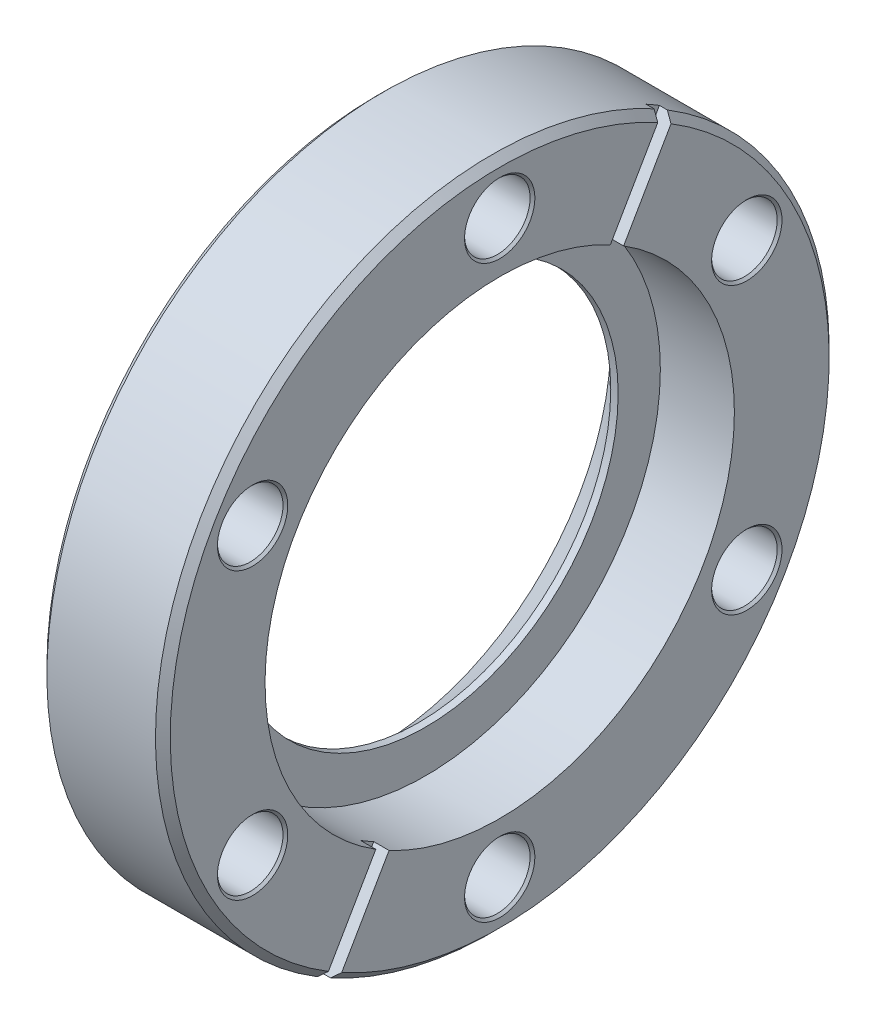
ISO-10303-21;
HEADER;
FILE_DESCRIPTION(('STEP AP214'),'2;1');
FILE_NAME('part.step','',(''),(''),'','','');
FILE_SCHEMA(('AUTOMOTIVE_DESIGN { 1 0 10303 214 1 1 1 1 }'));
ENDSEC;
DATA;
#1=APPLICATION_CONTEXT('core data for automotive mechanical design processes');
#2=APPLICATION_PROTOCOL_DEFINITION('international standard','automotive_design',2000,#1);
#3=PRODUCT_CONTEXT('',#1,'mechanical');
#4=PRODUCT('Part','Part','',(#3));
#5=PRODUCT_RELATED_PRODUCT_CATEGORY('part','',(#4));
#6=PRODUCT_DEFINITION_FORMATION('','',#4);
#7=PRODUCT_DEFINITION_CONTEXT('part definition',#1,'design');
#8=PRODUCT_DEFINITION('design','',#6,#7);
#9=PRODUCT_DEFINITION_SHAPE('','',#8);
#10=(LENGTH_UNIT() NAMED_UNIT(*) SI_UNIT(.MILLI.,.METRE.));
#11=(NAMED_UNIT(*) PLANE_ANGLE_UNIT() SI_UNIT($,.RADIAN.));
#12=(NAMED_UNIT(*) SI_UNIT($,.STERADIAN.) SOLID_ANGLE_UNIT());
#13=UNCERTAINTY_MEASURE_WITH_UNIT(LENGTH_MEASURE(1.E-05),#10,'distance_accuracy_value','');
#14=(GEOMETRIC_REPRESENTATION_CONTEXT(3) GLOBAL_UNCERTAINTY_ASSIGNED_CONTEXT((#13)) GLOBAL_UNIT_ASSIGNED_CONTEXT((#10,
#11,#12)) REPRESENTATION_CONTEXT('',''));
#15=CARTESIAN_POINT('',(0.,0.,0.));
#16=DIRECTION('',(0.,0.,1.));
#17=DIRECTION('',(1.,0.,0.));
#18=AXIS2_PLACEMENT_3D('',#15,#16,#17);
#19=CARTESIAN_POINT('',(11.1252,0.,0.));
#20=DIRECTION('',(1.,0.,0.));
#21=DIRECTION('',(0.,0.,-1.));
#22=AXIS2_PLACEMENT_3D('',#19,#20,#21);
#23=PLANE('',#22);
#24=CARTESIAN_POINT('',(11.1252,0.,0.));
#25=DIRECTION('',(-1.,0.,0.));
#26=DIRECTION('',(0.,0.,1.));
#27=AXIS2_PLACEMENT_3D('',#24,#25,#26);
#28=CIRCLE('',#27,34.671);
#29=CARTESIAN_POINT('',(11.1252,29.6245224936787,-18.0129372402594));
#30=VERTEX_POINT('',#29);
#31=CARTESIAN_POINT('',(11.1252,30.4119224936787,-16.6491204343796));
#32=VERTEX_POINT('',#31);
#33=EDGE_CURVE('E95',#30,#32,#28,.F.);
#34=ORIENTED_EDGE('',*,*,#33,.T.);
#35=DIRECTION('',(0.,-0.866025403784439,0.5));
#36=VECTOR('',#35,1.);
#37=CARTESIAN_POINT('',(11.1252,21.3017729097638,-11.3893731197486));
#38=LINE('',#37,#36);
#39=CARTESIAN_POINT('',(11.1252,21.3017729097638,-11.3893731197486));
#40=VERTEX_POINT('',#39);
#41=EDGE_CURVE('E101',#32,#40,#38,.T.);
#42=ORIENTED_EDGE('',*,*,#41,.T.);
#43=CARTESIAN_POINT('',(11.1252,0.,0.));
#44=DIRECTION('',(1.,0.,0.));
#45=DIRECTION('',(0.,0.,-1.));
#46=AXIS2_PLACEMENT_3D('',#43,#44,#45);
#47=CIRCLE('',#46,24.1554);
#48=CARTESIAN_POINT('',(11.1252,20.5143729097638,-12.7531899256283));
#49=VERTEX_POINT('',#48);
#50=EDGE_CURVE('E20',#40,#49,#47,.F.);
#51=ORIENTED_EDGE('',*,*,#50,.T.);
#52=DIRECTION('',(0.,0.866025403784439,-0.5));
#53=VECTOR('',#52,1.);
#54=CARTESIAN_POINT('',(11.1252,29.6245224936787,-18.0129372402594));
#55=LINE('',#54,#53);
#56=EDGE_CURVE('E117',#49,#30,#55,.T.);
#57=ORIENTED_EDGE('',*,*,#56,.T.);
#58=EDGE_LOOP('',(#34,#42,#51,#57));
#59=FACE_BOUND('',#58,.T.);
#60=ADVANCED_FACE('F17',(#59),#23,.T.);
#61=CARTESIAN_POINT('',(11.1252,0.,0.));
#62=DIRECTION('',(1.,0.,0.));
#63=DIRECTION('',(0.,0.,-1.));
#64=AXIS2_PLACEMENT_3D('',#61,#62,#63);
#65=PLANE('',#64);
#66=CARTESIAN_POINT('',(11.1252,0.,0.));
#67=DIRECTION('',(-1.,0.,0.));
#68=DIRECTION('',(0.,0.,1.));
#69=AXIS2_PLACEMENT_3D('',#66,#67,#68);
#70=CIRCLE('',#69,34.671);
#71=CARTESIAN_POINT('',(11.1252,-29.6245224936786,18.0129372402596));
#72=VERTEX_POINT('',#71);
#73=CARTESIAN_POINT('',(11.1252,-30.4119224936786,16.6491204343798));
#74=VERTEX_POINT('',#73);
#75=EDGE_CURVE('E126',#72,#74,#70,.F.);
#76=ORIENTED_EDGE('',*,*,#75,.T.);
#77=DIRECTION('',(0.,0.866025403784435,-0.500000000000006));
#78=VECTOR('',#77,1.);
#79=CARTESIAN_POINT('',(11.1252,-21.3017729097637,11.3893731197488));
#80=LINE('',#79,#78);
#81=CARTESIAN_POINT('',(11.1252,-21.3017729097637,11.3893731197488));
#82=VERTEX_POINT('',#81);
#83=EDGE_CURVE('E123',#74,#82,#80,.T.);
#84=ORIENTED_EDGE('',*,*,#83,.T.);
#85=CARTESIAN_POINT('',(11.1252,0.,0.));
#86=DIRECTION('',(1.,0.,0.));
#87=DIRECTION('',(0.,0.,-1.));
#88=AXIS2_PLACEMENT_3D('',#85,#86,#87);
#89=CIRCLE('',#88,24.1554);
#90=CARTESIAN_POINT('',(11.1252,-20.5143729097637,12.7531899256285));
#91=VERTEX_POINT('',#90);
#92=EDGE_CURVE('E375',#82,#91,#89,.F.);
#93=ORIENTED_EDGE('',*,*,#92,.T.);
#94=DIRECTION('',(0.,-0.866025403784435,0.500000000000006));
#95=VECTOR('',#94,1.);
#96=CARTESIAN_POINT('',(11.1252,-29.6245224936786,18.0129372402596));
#97=LINE('',#96,#95);
#98=EDGE_CURVE('E366',#91,#72,#97,.T.);
#99=ORIENTED_EDGE('',*,*,#98,.T.);
#100=EDGE_LOOP('',(#76,#84,#93,#99));
#101=FACE_BOUND('',#100,.T.);
#102=ADVANCED_FACE('F235',(#101),#65,.T.);
#103=CARTESIAN_POINT('',(11.1252,-21.3017729097637,11.3893731197488));
#104=DIRECTION('',(0.,-0.500000000000006,-0.866025403784435));
#105=DIRECTION('',(0.,0.866025403784435,-0.500000000000006));
#106=AXIS2_PLACEMENT_3D('',#103,#104,#105);
#107=PLANE('',#106);
#108=CARTESIAN_POINT('',(12.7,-29.7518370607877,16.2680199320121));
#109=CARTESIAN_POINT('',(12.5730003723783,-29.8618516220068,16.3315368685468));
#110=CARTESIAN_POINT('',(12.4460005585674,-29.971866022024,16.3950537120114));
#111=CARTESIAN_POINT('',(12.1920005585674,-30.1918944996543,16.5220872128007));
#112=CARTESIAN_POINT('',(12.0650003723783,-30.3019085772675,16.5856038701253));
#113=CARTESIAN_POINT('',(11.938,-30.4119224936786,16.6491204343798));
#114=B_SPLINE_CURVE_WITH_KNOTS('',3,(#108,#109,#110,#111,#112,#113),.UNSPECIFIED.,.F.,.F.,(4,2,
4),(0.,0.538886437856429,1.07777287571283),.UNSPECIFIED.);
#115=CARTESIAN_POINT('',(12.7,-29.7518370607876,16.2680199320121));
#116=VERTEX_POINT('',#115);
#117=CARTESIAN_POINT('',(11.938,-30.4119224936786,16.6491204343798));
#118=VERTEX_POINT('',#117);
#119=EDGE_CURVE('E122',#116,#118,#114,.T.);
#120=ORIENTED_EDGE('',*,*,#119,.F.);
#121=DIRECTION('',(0.,-0.866025403784435,0.500000000000005));
#122=VECTOR('',#121,1.);
#123=CARTESIAN_POINT('',(12.7,-21.3017729097637,11.3893731197488));
#124=LINE('',#123,#122);
#125=CARTESIAN_POINT('',(12.7,-21.3017729097637,11.3893731197488));
#126=VERTEX_POINT('',#125);
#127=EDGE_CURVE('E194',#126,#116,#124,.T.);
#128=ORIENTED_EDGE('',*,*,#127,.F.);
#129=DIRECTION('',(1.,0.,0.));
#130=VECTOR('',#129,1.);
#131=CARTESIAN_POINT('',(11.1252,-21.3017729097637,11.3893731197488));
#132=LINE('',#131,#130);
#133=EDGE_CURVE('E125',#82,#126,#132,.T.);
#134=ORIENTED_EDGE('',*,*,#133,.F.);
#135=ORIENTED_EDGE('',*,*,#83,.F.);
#136=DIRECTION('',(1.,0.,0.));
#137=VECTOR('',#136,1.);
#138=CARTESIAN_POINT('',(11.1252,-30.4119224936786,16.6491204343798));
#139=LINE('',#138,#137);
#140=EDGE_CURVE('E119',#118,#74,#139,.F.);
#141=ORIENTED_EDGE('',*,*,#140,.F.);
#142=EDGE_LOOP('',(#120,#128,#134,#135,#141));
#143=FACE_BOUND('',#142,.T.);
#144=ADVANCED_FACE('F231',(#143),#107,.F.);
#145=CARTESIAN_POINT('',(11.1252,29.6245224936787,-18.0129372402594));
#146=DIRECTION('',(0.,-0.5,-0.866025403784439));
#147=DIRECTION('',(0.,0.866025403784439,-0.5));
#148=AXIS2_PLACEMENT_3D('',#145,#146,#147);
#149=PLANE('',#148);
#150=CARTESIAN_POINT('',(11.938,29.6245224936787,-18.0129372402594));
#151=CARTESIAN_POINT('',(12.0650003723783,29.5145085772676,-17.9494206760048));
#152=CARTESIAN_POINT('',(12.1920005585674,29.4044944996544,-17.8859040186802));
#153=CARTESIAN_POINT('',(12.4460005585674,29.1844660220241,-17.7588705178909));
#154=CARTESIAN_POINT('',(12.5730003723783,29.0744516220069,-17.6953536744263));
#155=CARTESIAN_POINT('',(12.7,28.9644370607878,-17.6318367378916));
#156=B_SPLINE_CURVE_WITH_KNOTS('',3,(#150,#151,#152,#153,#154,#155),.UNSPECIFIED.,.F.,.F.,(4,2,
4),(0.,0.538886437856409,1.07777287571284),.UNSPECIFIED.);
#157=CARTESIAN_POINT('',(11.938,29.6245224936787,-18.0129372402594));
#158=VERTEX_POINT('',#157);
#159=CARTESIAN_POINT('',(12.7,28.9644370607878,-17.6318367378916));
#160=VERTEX_POINT('',#159);
#161=EDGE_CURVE('E107',#158,#160,#156,.T.);
#162=ORIENTED_EDGE('',*,*,#161,.F.);
#163=DIRECTION('',(1.,0.,0.));
#164=VECTOR('',#163,1.);
#165=CARTESIAN_POINT('',(11.1252,29.6245224936787,-18.0129372402594));
#166=LINE('',#165,#164);
#167=EDGE_CURVE('E109',#30,#158,#166,.T.);
#168=ORIENTED_EDGE('',*,*,#167,.F.);
#169=ORIENTED_EDGE('',*,*,#56,.F.);
#170=DIRECTION('',(1.,0.,0.));
#171=VECTOR('',#170,1.);
#172=CARTESIAN_POINT('',(11.1252,20.5143729097638,-12.7531899256283));
#173=LINE('',#172,#171);
#174=CARTESIAN_POINT('',(12.7,20.5143729097638,-12.7531899256283));
#175=VERTEX_POINT('',#174);
#176=EDGE_CURVE('E90',#175,#49,#173,.F.);
#177=ORIENTED_EDGE('',*,*,#176,.F.);
#178=DIRECTION('',(0.,-0.866025403784439,0.5));
#179=VECTOR('',#178,1.);
#180=CARTESIAN_POINT('',(12.7,28.9644370607878,-17.6318367378916));
#181=LINE('',#180,#179);
#182=EDGE_CURVE('E359',#160,#175,#181,.T.);
#183=ORIENTED_EDGE('',*,*,#182,.F.);
#184=EDGE_LOOP('',(#162,#168,#169,#177,#183));
#185=FACE_BOUND('',#184,.T.);
#186=ADVANCED_FACE('F234',(#185),#149,.F.);
#187=CARTESIAN_POINT('',(11.1252,21.3017729097638,-11.3893731197486));
#188=DIRECTION('',(0.,0.5,0.866025403784439));
#189=DIRECTION('',(0.,-0.866025403784439,0.5));
#190=AXIS2_PLACEMENT_3D('',#187,#188,#189);
#191=PLANE('',#190);
#192=CARTESIAN_POINT('',(12.7,29.7518370607877,-16.2680199320119));
#193=CARTESIAN_POINT('',(12.5730003723783,29.8618516220069,-16.3315368685465));
#194=CARTESIAN_POINT('',(12.4460005585674,29.9718660220241,-16.3950537120112));
#195=CARTESIAN_POINT('',(12.1920005585674,30.1918944996544,-16.5220872128004));
#196=CARTESIAN_POINT('',(12.0650003723783,30.3019085772676,-16.585603870125));
#197=CARTESIAN_POINT('',(11.938,30.4119224936787,-16.6491204343796));
#198=B_SPLINE_CURVE_WITH_KNOTS('',3,(#192,#193,#194,#195,#196,#197),.UNSPECIFIED.,.F.,.F.,(4,2,
4),(0.,0.53888643785644,1.07777287571285),.UNSPECIFIED.);
#199=CARTESIAN_POINT('',(12.7,29.7518370607877,-16.2680199320119));
#200=VERTEX_POINT('',#199);
#201=CARTESIAN_POINT('',(11.938,30.4119224936787,-16.6491204343796));
#202=VERTEX_POINT('',#201);
#203=EDGE_CURVE('E105',#200,#202,#198,.T.);
#204=ORIENTED_EDGE('',*,*,#203,.F.);
#205=DIRECTION('',(0.,0.866025403784439,-0.5));
#206=VECTOR('',#205,1.);
#207=CARTESIAN_POINT('',(12.7,21.3017729097638,-11.3893731197486));
#208=LINE('',#207,#206);
#209=CARTESIAN_POINT('',(12.7,21.3017729097638,-11.3893731197486));
#210=VERTEX_POINT('',#209);
#211=EDGE_CURVE('E104',#210,#200,#208,.T.);
#212=ORIENTED_EDGE('',*,*,#211,.F.);
#213=DIRECTION('',(1.,0.,0.));
#214=VECTOR('',#213,1.);
#215=CARTESIAN_POINT('',(11.1252,21.3017729097638,-11.3893731197486));
#216=LINE('',#215,#214);
#217=EDGE_CURVE('E87',#40,#210,#216,.T.);
#218=ORIENTED_EDGE('',*,*,#217,.F.);
#219=ORIENTED_EDGE('',*,*,#41,.F.);
#220=DIRECTION('',(1.,0.,0.));
#221=VECTOR('',#220,1.);
#222=CARTESIAN_POINT('',(11.1252,30.4119224936787,-16.6491204343796));
#223=LINE('',#222,#221);
#224=EDGE_CURVE('E113',#202,#32,#223,.F.);
#225=ORIENTED_EDGE('',*,*,#224,.F.);
#226=EDGE_LOOP('',(#204,#212,#218,#219,#225));
#227=FACE_BOUND('',#226,.T.);
#228=ADVANCED_FACE('F99',(#227),#191,.F.);
#229=CARTESIAN_POINT('',(11.1252,-29.6245224936786,18.0129372402596));
#230=DIRECTION('',(0.,0.500000000000006,0.866025403784435));
#231=DIRECTION('',(0.,-0.866025403784435,0.500000000000006));
#232=AXIS2_PLACEMENT_3D('',#229,#230,#231);
#233=PLANE('',#232);
#234=CARTESIAN_POINT('',(11.938,-29.6245224936786,18.0129372402596));
#235=CARTESIAN_POINT('',(12.0650003723783,-29.5145085772674,17.949420676005));
#236=CARTESIAN_POINT('',(12.1920005585674,-29.4044944996543,17.8859040186804));
#237=CARTESIAN_POINT('',(12.4460005585674,-29.1844660220239,17.7588705178911));
#238=CARTESIAN_POINT('',(12.5730003723783,-29.0744516220068,17.6953536744265));
#239=CARTESIAN_POINT('',(12.7,-28.9644370607876,17.6318367378918));
#240=B_SPLINE_CURVE_WITH_KNOTS('',3,(#234,#235,#236,#237,#238,#239),.UNSPECIFIED.,.F.,.F.,(4,2,
4),(0.,0.538886437856417,1.07777287571286),.UNSPECIFIED.);
#241=CARTESIAN_POINT('',(11.938,-29.6245224936786,18.0129372402596));
#242=VERTEX_POINT('',#241);
#243=CARTESIAN_POINT('',(12.7,-28.9644370607876,17.6318367378918));
#244=VERTEX_POINT('',#243);
#245=EDGE_CURVE('E35',#242,#244,#240,.T.);
#246=ORIENTED_EDGE('',*,*,#245,.F.);
#247=DIRECTION('',(1.,0.,0.));
#248=VECTOR('',#247,1.);
#249=CARTESIAN_POINT('',(11.1252,-29.6245224936786,18.0129372402596));
#250=LINE('',#249,#248);
#251=EDGE_CURVE('E195',#72,#242,#250,.T.);
#252=ORIENTED_EDGE('',*,*,#251,.F.);
#253=ORIENTED_EDGE('',*,*,#98,.F.);
#254=DIRECTION('',(1.,0.,0.));
#255=VECTOR('',#254,1.);
#256=CARTESIAN_POINT('',(11.1252,-20.5143729097637,12.7531899256285));
#257=LINE('',#256,#255);
#258=CARTESIAN_POINT('',(12.7,-20.5143729097637,12.7531899256285));
#259=VERTEX_POINT('',#258);
#260=EDGE_CURVE('E364',#259,#91,#257,.F.);
#261=ORIENTED_EDGE('',*,*,#260,.F.);
#262=DIRECTION('',(0.,0.866025403784435,-0.500000000000006));
#263=VECTOR('',#262,1.);
#264=CARTESIAN_POINT('',(12.7,-28.9644370607876,17.6318367378918));
#265=LINE('',#264,#263);
#266=EDGE_CURVE('E187',#244,#259,#265,.T.);
#267=ORIENTED_EDGE('',*,*,#266,.F.);
#268=EDGE_LOOP('',(#246,#252,#253,#261,#267));
#269=FACE_BOUND('',#268,.T.);
#270=ADVANCED_FACE('F200',(#269),#233,.F.);
#271=CARTESIAN_POINT('',(12.7,0.,0.));
#272=DIRECTION('',(1.,0.,0.));
#273=DIRECTION('',(0.,0.,-1.));
#274=AXIS2_PLACEMENT_3D('',#271,#272,#273);
#275=PLANE('',#274);
#276=ORIENTED_EDGE('',*,*,#182,.T.);
#277=CARTESIAN_POINT('',(12.7,0.,0.));
#278=DIRECTION('',(1.,0.,0.));
#279=DIRECTION('',(0.,0.,-1.));
#280=AXIS2_PLACEMENT_3D('',#277,#278,#279);
#281=CIRCLE('',#280,24.1554);
#282=EDGE_CURVE('E184',#175,#126,#281,.F.);
#283=ORIENTED_EDGE('',*,*,#282,.T.);
#284=ORIENTED_EDGE('',*,*,#127,.T.);
#285=CARTESIAN_POINT('',(12.7,0.,0.));
#286=DIRECTION('',(-1.,0.,0.));
#287=DIRECTION('',(0.,0.,1.));
#288=AXIS2_PLACEMENT_3D('',#285,#286,#287);
#289=CIRCLE('',#288,33.909);
#290=EDGE_CURVE('E160',#160,#116,#289,.T.);
#291=ORIENTED_EDGE('',*,*,#290,.F.);
#292=EDGE_LOOP('',(#276,#283,#284,#291));
#293=FACE_BOUND('',#292,.T.);
#294=CARTESIAN_POINT('',(12.6999999999384,14.6843749999999,-25.4340835773943));
#295=DIRECTION('',(1.,0.,0.));
#296=DIRECTION('',(0.,0.,-1.));
#297=AXIS2_PLACEMENT_3D('',#294,#295,#296);
#298=CIRCLE('',#297,3.61949999997105);
#299=CARTESIAN_POINT('',(12.6999999999384,14.6843749999999,-29.0535835773653));
#300=VERTEX_POINT('',#299);
#301=EDGE_CURVE('E166',#300,#300,#298,.F.);
#302=ORIENTED_EDGE('',*,*,#301,.T.);
#303=EDGE_LOOP('',(#302));
#304=FACE_BOUND('',#303,.T.);
#305=CARTESIAN_POINT('',(12.6999999999953,-14.6843750000001,-25.4340835773942));
#306=DIRECTION('',(1.,0.,0.));
#307=DIRECTION('',(0.,0.,-1.));
#308=AXIS2_PLACEMENT_3D('',#305,#306,#307);
#309=CIRCLE('',#308,3.61950000002799);
#310=CARTESIAN_POINT('',(12.6999999999953,-14.6843750000001,-29.0535835774222));
#311=VERTEX_POINT('',#310);
#312=EDGE_CURVE('E169',#311,#311,#309,.F.);
#313=ORIENTED_EDGE('',*,*,#312,.T.);
#314=EDGE_LOOP('',(#313));
#315=FACE_BOUND('',#314,.T.);
#316=CARTESIAN_POINT('',(12.6999999999384,-29.36875,2.05131051034257E-13));
#317=DIRECTION('',(1.,0.,0.));
#318=DIRECTION('',(0.,0.,-1.));
#319=AXIS2_PLACEMENT_3D('',#316,#317,#318);
#320=CIRCLE('',#319,3.61949999995679);
#321=CARTESIAN_POINT('',(12.6999999999384,-29.36875,-3.61949999995659));
#322=VERTEX_POINT('',#321);
#323=EDGE_CURVE('E172',#322,#322,#320,.F.);
#324=ORIENTED_EDGE('',*,*,#323,.T.);
#325=EDGE_LOOP('',(#324));
#326=FACE_BOUND('',#325,.T.);
#327=ADVANCED_FACE('F392',(#293,#304,#315,#326),#275,.T.);
#328=CARTESIAN_POINT('',(12.7,0.,0.));
#329=DIRECTION('',(1.,0.,0.));
#330=DIRECTION('',(0.,0.,-1.));
#331=AXIS2_PLACEMENT_3D('',#328,#329,#330);
#332=PLANE('',#331);
#333=CARTESIAN_POINT('',(12.7,0.,0.));
#334=DIRECTION('',(1.,0.,0.));
#335=DIRECTION('',(0.,0.,-1.));
#336=AXIS2_PLACEMENT_3D('',#333,#334,#335);
#337=CIRCLE('',#336,24.1554);
#338=EDGE_CURVE('E181',#259,#210,#337,.F.);
#339=ORIENTED_EDGE('',*,*,#338,.T.);
#340=ORIENTED_EDGE('',*,*,#211,.T.);
#341=CARTESIAN_POINT('',(12.7,0.,0.));
#342=DIRECTION('',(-1.,0.,0.));
#343=DIRECTION('',(0.,0.,1.));
#344=AXIS2_PLACEMENT_3D('',#341,#342,#343);
#345=CIRCLE('',#344,33.909);
#346=EDGE_CURVE('E158',#244,#200,#345,.T.);
#347=ORIENTED_EDGE('',*,*,#346,.F.);
#348=ORIENTED_EDGE('',*,*,#266,.T.);
#349=EDGE_LOOP('',(#339,#340,#347,#348));
#350=FACE_BOUND('',#349,.T.);
#351=CARTESIAN_POINT('',(12.6999999999384,29.36875,0.));
#352=DIRECTION('',(1.,0.,0.));
#353=DIRECTION('',(0.,0.,-1.));
#354=AXIS2_PLACEMENT_3D('',#351,#352,#353);
#355=CIRCLE('',#354,3.61949999995659);
#356=CARTESIAN_POINT('',(12.6999999999384,29.36875,-3.61949999995659));
#357=VERTEX_POINT('',#356);
#358=EDGE_CURVE('E163',#357,#357,#355,.F.);
#359=ORIENTED_EDGE('',*,*,#358,.T.);
#360=EDGE_LOOP('',(#359));
#361=FACE_BOUND('',#360,.T.);
#362=CARTESIAN_POINT('',(12.6999999999953,-14.6843749999998,25.4340835773944));
#363=DIRECTION('',(1.,0.,0.));
#364=DIRECTION('',(0.,1.,0.));
#365=AXIS2_PLACEMENT_3D('',#362,#363,#364);
#366=CIRCLE('',#365,3.61949999999907);
#367=CARTESIAN_POINT('',(12.6999999999953,-11.0648750000007,25.4340835773944));
#368=VERTEX_POINT('',#367);
#369=EDGE_CURVE('E175',#368,#368,#366,.F.);
#370=ORIENTED_EDGE('',*,*,#369,.T.);
#371=EDGE_LOOP('',(#370));
#372=FACE_BOUND('',#371,.T.);
#373=CARTESIAN_POINT('',(12.7000000000521,14.6843750000003,25.4340835773941));
#374=DIRECTION('',(1.,0.,0.));
#375=DIRECTION('',(0.,1.,0.));
#376=AXIS2_PLACEMENT_3D('',#373,#374,#375);
#377=CIRCLE('',#376,3.61950000005561);
#378=CARTESIAN_POINT('',(12.7000000000521,18.3038750000559,25.4340835773941));
#379=VERTEX_POINT('',#378);
#380=EDGE_CURVE('E178',#379,#379,#377,.F.);
#381=ORIENTED_EDGE('',*,*,#380,.T.);
#382=EDGE_LOOP('',(#381));
#383=FACE_BOUND('',#382,.T.);
#384=ADVANCED_FACE('F383',(#350,#361,#372,#383),#332,.T.);
#385=CARTESIAN_POINT('',(5.08,0.,0.));
#386=DIRECTION('',(1.,0.,0.));
#387=DIRECTION('',(0.,0.,-1.));
#388=AXIS2_PLACEMENT_3D('',#385,#386,#387);
#389=CYLINDRICAL_SURFACE('',#388,24.1554);
#390=ORIENTED_EDGE('',*,*,#282,.F.);
#391=ORIENTED_EDGE('',*,*,#176,.T.);
#392=ORIENTED_EDGE('',*,*,#50,.F.);
#393=ORIENTED_EDGE('',*,*,#217,.T.);
#394=ORIENTED_EDGE('',*,*,#338,.F.);
#395=ORIENTED_EDGE('',*,*,#260,.T.);
#396=ORIENTED_EDGE('',*,*,#92,.F.);
#397=ORIENTED_EDGE('',*,*,#133,.T.);
#398=EDGE_LOOP('',(#390,#391,#392,#393,#394,#395,#396,#397));
#399=FACE_BOUND('',#398,.T.);
#400=CARTESIAN_POINT('',(5.08,0.,0.));
#401=DIRECTION('',(1.,0.,0.));
#402=DIRECTION('',(0.,0.,-1.));
#403=AXIS2_PLACEMENT_3D('',#400,#401,#402);
#404=CIRCLE('',#403,24.1554);
#405=CARTESIAN_POINT('',(5.08,0.,-24.1554));
#406=VERTEX_POINT('',#405);
#407=EDGE_CURVE('E154',#406,#406,#404,.T.);
#408=ORIENTED_EDGE('',*,*,#407,.F.);
#409=EDGE_LOOP('',(#408));
#410=FACE_BOUND('',#409,.T.);
#411=ADVANCED_FACE('F83',(#399,#410),#389,.F.);
#412=CARTESIAN_POINT('',(12.700000000109,14.6843750000003,25.4340835773941));
#413=DIRECTION('',(1.,0.,0.));
#414=DIRECTION('',(0.,1.,0.));
#415=AXIS2_PLACEMENT_3D('',#412,#413,#414);
#416=CONICAL_SURFACE('',#415,3.61950000011245,0.785398163397448);
#417=ORIENTED_EDGE('',*,*,#380,.F.);
#418=EDGE_LOOP('',(#417));
#419=FACE_BOUND('',#418,.T.);
#420=CARTESIAN_POINT('',(12.454001,14.6843750000003,25.4340835773941));
#421=DIRECTION('',(1.,0.,0.));
#422=DIRECTION('',(0.,0.,-1.));
#423=AXIS2_PLACEMENT_3D('',#420,#421,#422);
#424=CIRCLE('',#423,3.373501);
#425=CARTESIAN_POINT('',(12.454001,14.6843750000003,22.0605825773941));
#426=VERTEX_POINT('',#425);
#427=EDGE_CURVE('E157',#426,#426,#424,.F.);
#428=ORIENTED_EDGE('',*,*,#427,.T.);
#429=EDGE_LOOP('',(#428));
#430=FACE_BOUND('',#429,.T.);
#431=ADVANCED_FACE('F450',(#419,#430),#416,.F.);
#432=CARTESIAN_POINT('',(12.6999999999384,-14.6843749999998,25.4340835773944));
#433=DIRECTION('',(1.,0.,0.));
#434=DIRECTION('',(0.,1.,0.));
#435=AXIS2_PLACEMENT_3D('',#432,#433,#434);
#436=CONICAL_SURFACE('',#435,3.61949999994223,0.785398163397448);
#437=ORIENTED_EDGE('',*,*,#369,.F.);
#438=EDGE_LOOP('',(#437));
#439=FACE_BOUND('',#438,.T.);
#440=CARTESIAN_POINT('',(12.454001,-14.6843749999998,25.4340835773944));
#441=DIRECTION('',(1.,0.,0.));
#442=DIRECTION('',(0.,0.,-1.));
#443=AXIS2_PLACEMENT_3D('',#440,#441,#442);
#444=CIRCLE('',#443,3.373501);
#445=CARTESIAN_POINT('',(12.454001,-14.6843749999998,22.0605825773944));
#446=VERTEX_POINT('',#445);
#447=EDGE_CURVE('E352',#446,#446,#444,.F.);
#448=ORIENTED_EDGE('',*,*,#447,.T.);
#449=EDGE_LOOP('',(#448));
#450=FACE_BOUND('',#449,.T.);
#451=ADVANCED_FACE('F453',(#439,#450),#436,.F.);
#452=CARTESIAN_POINT('',(12.6999999998816,-29.36875,2.05131051034257E-13));
#453=DIRECTION('',(1.,0.,0.));
#454=DIRECTION('',(0.,0.,-1.));
#455=AXIS2_PLACEMENT_3D('',#452,#453,#454);
#456=CONICAL_SURFACE('',#455,3.61949999989995,0.785398163281912);
#457=ORIENTED_EDGE('',*,*,#323,.F.);
#458=EDGE_LOOP('',(#457));
#459=FACE_BOUND('',#458,.T.);
#460=CARTESIAN_POINT('',(12.454001,-29.36875,2.05081003923162E-13));
#461=DIRECTION('',(1.,0.,0.));
#462=DIRECTION('',(0.,0.,-1.));
#463=AXIS2_PLACEMENT_3D('',#460,#461,#462);
#464=CIRCLE('',#463,3.373501);
#465=CARTESIAN_POINT('',(12.454001,-29.36875,-3.37350099999979));
#466=VERTEX_POINT('',#465);
#467=EDGE_CURVE('E349',#466,#466,#464,.F.);
#468=ORIENTED_EDGE('',*,*,#467,.T.);
#469=EDGE_LOOP('',(#468));
#470=FACE_BOUND('',#469,.T.);
#471=ADVANCED_FACE('F457',(#459,#470),#456,.F.);
#472=CARTESIAN_POINT('',(12.6999999998816,-14.6843750000001,-25.4340835773942));
#473=DIRECTION('',(1.,0.,0.));
#474=DIRECTION('',(0.,0.,-1.));
#475=AXIS2_PLACEMENT_3D('',#472,#473,#474);
#476=CONICAL_SURFACE('',#475,3.61949999991431,0.785398163397448);
#477=ORIENTED_EDGE('',*,*,#312,.F.);
#478=EDGE_LOOP('',(#477));
#479=FACE_BOUND('',#478,.T.);
#480=CARTESIAN_POINT('',(12.454001,-14.6843750000001,-25.4340835773942));
#481=DIRECTION('',(1.,0.,0.));
#482=DIRECTION('',(0.,0.,-1.));
#483=AXIS2_PLACEMENT_3D('',#480,#481,#482);
#484=CIRCLE('',#483,3.373501);
#485=CARTESIAN_POINT('',(12.454001,-14.6843750000001,-28.8075845773942));
#486=VERTEX_POINT('',#485);
#487=EDGE_CURVE('E346',#486,#486,#484,.F.);
#488=ORIENTED_EDGE('',*,*,#487,.T.);
#489=EDGE_LOOP('',(#488));
#490=FACE_BOUND('',#489,.T.);
#491=ADVANCED_FACE('F461',(#479,#490),#476,.F.);
#492=CARTESIAN_POINT('',(12.6999999998816,14.6843749999999,-25.4340835773943));
#493=DIRECTION('',(1.,0.,0.));
#494=DIRECTION('',(0.,0.,-1.));
#495=AXIS2_PLACEMENT_3D('',#492,#493,#494);
#496=CONICAL_SURFACE('',#495,3.61949999991421,0.785398163512984);
#497=ORIENTED_EDGE('',*,*,#301,.F.);
#498=EDGE_LOOP('',(#497));
#499=FACE_BOUND('',#498,.T.);
#500=CARTESIAN_POINT('',(12.454001,14.6843749999999,-25.4340835773943));
#501=DIRECTION('',(1.,0.,0.));
#502=DIRECTION('',(0.,0.,-1.));
#503=AXIS2_PLACEMENT_3D('',#500,#501,#502);
#504=CIRCLE('',#503,3.373501);
#505=CARTESIAN_POINT('',(12.454001,14.6843749999999,-28.8075845773943));
#506=VERTEX_POINT('',#505);
#507=EDGE_CURVE('E343',#506,#506,#504,.F.);
#508=ORIENTED_EDGE('',*,*,#507,.T.);
#509=EDGE_LOOP('',(#508));
#510=FACE_BOUND('',#509,.T.);
#511=ADVANCED_FACE('F464',(#499,#510),#496,.F.);
#512=CARTESIAN_POINT('',(12.6999999998816,29.36875,0.));
#513=DIRECTION('',(1.,0.,0.));
#514=DIRECTION('',(0.,0.,-1.));
#515=AXIS2_PLACEMENT_3D('',#512,#513,#514);
#516=CONICAL_SURFACE('',#515,3.61949999989974,0.785398163397448);
#517=ORIENTED_EDGE('',*,*,#358,.F.);
#518=EDGE_LOOP('',(#517));
#519=FACE_BOUND('',#518,.T.);
#520=CARTESIAN_POINT('',(12.454001,29.36875,0.));
#521=DIRECTION('',(1.,0.,0.));
#522=DIRECTION('',(0.,0.,-1.));
#523=AXIS2_PLACEMENT_3D('',#520,#521,#522);
#524=CIRCLE('',#523,3.373501);
#525=CARTESIAN_POINT('',(12.454001,29.36875,-3.373501));
#526=VERTEX_POINT('',#525);
#527=EDGE_CURVE('E338',#526,#526,#524,.F.);
#528=ORIENTED_EDGE('',*,*,#527,.T.);
#529=EDGE_LOOP('',(#528));
#530=FACE_BOUND('',#529,.T.);
#531=ADVANCED_FACE('F215',(#519,#530),#516,.F.);
#532=CARTESIAN_POINT('',(11.938,0.,0.));
#533=DIRECTION('',(-1.,0.,0.));
#534=DIRECTION('',(0.,0.,1.));
#535=AXIS2_PLACEMENT_3D('',#532,#533,#534);
#536=CONICAL_SURFACE('',#535,34.671,0.785398163397443);
#537=ORIENTED_EDGE('',*,*,#161,.T.);
#538=ORIENTED_EDGE('',*,*,#290,.T.);
#539=ORIENTED_EDGE('',*,*,#119,.T.);
#540=CARTESIAN_POINT('',(11.938,0.,0.));
#541=DIRECTION('',(-1.,0.,0.));
#542=DIRECTION('',(0.,0.,1.));
#543=AXIS2_PLACEMENT_3D('',#540,#541,#542);
#544=CIRCLE('',#543,34.671);
#545=EDGE_CURVE('E333',#158,#118,#544,.T.);
#546=ORIENTED_EDGE('',*,*,#545,.F.);
#547=EDGE_LOOP('',(#537,#538,#539,#546));
#548=FACE_BOUND('',#547,.T.);
#549=ADVANCED_FACE('F209',(#548),#536,.T.);
#550=CARTESIAN_POINT('',(11.938,0.,0.));
#551=DIRECTION('',(-1.,0.,0.));
#552=DIRECTION('',(0.,0.,1.));
#553=AXIS2_PLACEMENT_3D('',#550,#551,#552);
#554=CONICAL_SURFACE('',#553,34.671,0.785398163397456);
#555=CARTESIAN_POINT('',(11.938,0.,0.));
#556=DIRECTION('',(-1.,0.,0.));
#557=DIRECTION('',(0.,0.,1.));
#558=AXIS2_PLACEMENT_3D('',#555,#556,#557);
#559=CIRCLE('',#558,34.671);
#560=EDGE_CURVE('E153',#242,#202,#559,.T.);
#561=ORIENTED_EDGE('',*,*,#560,.F.);
#562=ORIENTED_EDGE('',*,*,#245,.T.);
#563=ORIENTED_EDGE('',*,*,#346,.T.);
#564=ORIENTED_EDGE('',*,*,#203,.T.);
#565=EDGE_LOOP('',(#561,#562,#563,#564));
#566=FACE_BOUND('',#565,.T.);
#567=ADVANCED_FACE('F203',(#566),#554,.T.);
#568=CARTESIAN_POINT('',(5.08,0.,0.));
#569=DIRECTION('',(1.,0.,0.));
#570=DIRECTION('',(0.,0.,-1.));
#571=AXIS2_PLACEMENT_3D('',#568,#569,#570);
#572=PLANE('',#571);
#573=CARTESIAN_POINT('',(5.08,0.,0.));
#574=DIRECTION('',(1.,0.,0.));
#575=DIRECTION('',(0.,0.,-1.));
#576=AXIS2_PLACEMENT_3D('',#573,#574,#575);
#577=CIRCLE('',#576,19.812);
#578=CARTESIAN_POINT('',(5.08,0.,-19.812));
#579=VERTEX_POINT('',#578);
#580=EDGE_CURVE('E149',#579,#579,#577,.F.);
#581=ORIENTED_EDGE('',*,*,#580,.T.);
#582=EDGE_LOOP('',(#581));
#583=FACE_BOUND('',#582,.T.);
#584=ORIENTED_EDGE('',*,*,#407,.T.);
#585=EDGE_LOOP('',(#584));
#586=FACE_BOUND('',#585,.T.);
#587=ADVANCED_FACE('F208',(#583,#586),#572,.T.);
#588=CARTESIAN_POINT('',(12.7,14.6843750000003,25.4340835773941));
#589=DIRECTION('',(1.,0.,0.));
#590=DIRECTION('',(0.,0.,-1.));
#591=AXIS2_PLACEMENT_3D('',#588,#589,#590);
#592=CYLINDRICAL_SURFACE('',#591,3.373501);
#593=ORIENTED_EDGE('',*,*,#427,.F.);
#594=EDGE_LOOP('',(#593));
#595=FACE_BOUND('',#594,.T.);
#596=CARTESIAN_POINT('',(0.245998999957919,14.6843750000003,25.4340835773941));
#597=DIRECTION('',(-1.,0.,0.));
#598=DIRECTION('',(0.,0.,1.));
#599=AXIS2_PLACEMENT_3D('',#596,#597,#598);
#600=CIRCLE('',#599,3.37350100001334);
#601=CARTESIAN_POINT('',(0.245998999957919,14.6843750000003,28.8075845774074));
#602=VERTEX_POINT('',#601);
#603=EDGE_CURVE('E152',#602,#602,#600,.T.);
#604=ORIENTED_EDGE('',*,*,#603,.T.);
#605=EDGE_LOOP('',(#604));
#606=FACE_BOUND('',#605,.T.);
#607=ADVANCED_FACE('F311',(#595,#606),#592,.F.);
#608=CARTESIAN_POINT('',(12.7,-14.6843749999998,25.4340835773944));
#609=DIRECTION('',(1.,0.,0.));
#610=DIRECTION('',(0.,0.,-1.));
#611=AXIS2_PLACEMENT_3D('',#608,#609,#610);
#612=CYLINDRICAL_SURFACE('',#611,3.373501);
#613=ORIENTED_EDGE('',*,*,#447,.F.);
#614=EDGE_LOOP('',(#613));
#615=FACE_BOUND('',#614,.T.);
#616=CARTESIAN_POINT('',(0.245999000014763,-14.6843749999998,25.4340835773944));
#617=DIRECTION('',(-1.,0.,0.));
#618=DIRECTION('',(0.,0.,1.));
#619=AXIS2_PLACEMENT_3D('',#616,#617,#618);
#620=CIRCLE('',#619,3.37350100001303);
#621=CARTESIAN_POINT('',(0.245999000014763,-14.6843749999998,28.8075845774074));
#622=VERTEX_POINT('',#621);
#623=EDGE_CURVE('E325',#622,#622,#620,.T.);
#624=ORIENTED_EDGE('',*,*,#623,.T.);
#625=EDGE_LOOP('',(#624));
#626=FACE_BOUND('',#625,.T.);
#627=ADVANCED_FACE('F308',(#615,#626),#612,.F.);
#628=CARTESIAN_POINT('',(12.7,-29.36875,2.05081003923162E-13));
#629=DIRECTION('',(1.,0.,0.));
#630=DIRECTION('',(0.,0.,-1.));
#631=AXIS2_PLACEMENT_3D('',#628,#629,#630);
#632=CYLINDRICAL_SURFACE('',#631,3.373501);
#633=ORIENTED_EDGE('',*,*,#467,.F.);
#634=EDGE_LOOP('',(#633));
#635=FACE_BOUND('',#634,.T.);
#636=CARTESIAN_POINT('',(0.245999000014763,-29.36875,2.05081003923162E-13));
#637=DIRECTION('',(-1.,0.,0.));
#638=DIRECTION('',(0.,0.,1.));
#639=AXIS2_PLACEMENT_3D('',#636,#637,#638);
#640=CIRCLE('',#639,3.37350099999846);
#641=CARTESIAN_POINT('',(0.245999000014763,-29.36875,3.37350099999867));
#642=VERTEX_POINT('',#641);
#643=EDGE_CURVE('E328',#642,#642,#640,.T.);
#644=ORIENTED_EDGE('',*,*,#643,.T.);
#645=EDGE_LOOP('',(#644));
#646=FACE_BOUND('',#645,.T.);
#647=ADVANCED_FACE('F304',(#635,#646),#632,.F.);
#648=CARTESIAN_POINT('',(12.7,-14.6843750000001,-25.4340835773942));
#649=DIRECTION('',(1.,0.,0.));
#650=DIRECTION('',(0.,0.,-1.));
#651=AXIS2_PLACEMENT_3D('',#648,#649,#650);
#652=CYLINDRICAL_SURFACE('',#651,3.373501);
#653=ORIENTED_EDGE('',*,*,#487,.F.);
#654=EDGE_LOOP('',(#653));
#655=FACE_BOUND('',#654,.T.);
#656=CARTESIAN_POINT('',(0.245998999957919,-14.6843750000001,-25.4340835773942));
#657=DIRECTION('',(-1.,0.,0.));
#658=DIRECTION('',(0.,0.,1.));
#659=AXIS2_PLACEMENT_3D('',#656,#657,#658);
#660=CIRCLE('',#659,3.37350100004095);
#661=CARTESIAN_POINT('',(0.245998999957919,-14.6843750000001,-22.0605825773532));
#662=VERTEX_POINT('',#661);
#663=EDGE_CURVE('E414',#662,#662,#660,.T.);
#664=ORIENTED_EDGE('',*,*,#663,.T.);
#665=EDGE_LOOP('',(#664));
#666=FACE_BOUND('',#665,.T.);
#667=ADVANCED_FACE('F300',(#655,#666),#652,.F.);
#668=CARTESIAN_POINT('',(12.7,14.6843749999999,-25.4340835773943));
#669=DIRECTION('',(1.,0.,0.));
#670=DIRECTION('',(0.,0.,-1.));
#671=AXIS2_PLACEMENT_3D('',#668,#669,#670);
#672=CYLINDRICAL_SURFACE('',#671,3.373501);
#673=ORIENTED_EDGE('',*,*,#507,.F.);
#674=EDGE_LOOP('',(#673));
#675=FACE_BOUND('',#674,.T.);
#676=CARTESIAN_POINT('',(0.245998999957919,14.6843749999999,-25.4340835773943));
#677=DIRECTION('',(-1.,0.,0.));
#678=DIRECTION('',(0.,0.,1.));
#679=AXIS2_PLACEMENT_3D('',#676,#677,#678);
#680=CIRCLE('',#679,3.37350100004105);
#681=CARTESIAN_POINT('',(0.245998999957919,14.6843749999999,-22.0605825773532));
#682=VERTEX_POINT('',#681);
#683=EDGE_CURVE('E409',#682,#682,#680,.T.);
#684=ORIENTED_EDGE('',*,*,#683,.T.);
#685=EDGE_LOOP('',(#684));
#686=FACE_BOUND('',#685,.T.);
#687=ADVANCED_FACE('F296',(#675,#686),#672,.F.);
#688=CARTESIAN_POINT('',(12.7,29.36875,0.));
#689=DIRECTION('',(1.,0.,0.));
#690=DIRECTION('',(0.,0.,-1.));
#691=AXIS2_PLACEMENT_3D('',#688,#689,#690);
#692=CYLINDRICAL_SURFACE('',#691,3.373501);
#693=ORIENTED_EDGE('',*,*,#527,.F.);
#694=EDGE_LOOP('',(#693));
#695=FACE_BOUND('',#694,.T.);
#696=CARTESIAN_POINT('',(0.245999000014763,29.36875,0.));
#697=DIRECTION('',(-1.,0.,0.));
#698=DIRECTION('',(0.,0.,1.));
#699=AXIS2_PLACEMENT_3D('',#696,#697,#698);
#700=CIRCLE('',#699,3.37350099999867);
#701=CARTESIAN_POINT('',(0.245999000014763,29.36875,3.37350099999867));
#702=VERTEX_POINT('',#701);
#703=EDGE_CURVE('E404',#702,#702,#700,.T.);
#704=ORIENTED_EDGE('',*,*,#703,.T.);
#705=EDGE_LOOP('',(#704));
#706=FACE_BOUND('',#705,.T.);
#707=ADVANCED_FACE('F292',(#695,#706),#692,.F.);
#708=CARTESIAN_POINT('',(12.7,0.,0.));
#709=DIRECTION('',(-1.,0.,0.));
#710=DIRECTION('',(0.,0.,1.));
#711=AXIS2_PLACEMENT_3D('',#708,#709,#710);
#712=CYLINDRICAL_SURFACE('',#711,34.671);
#713=ORIENTED_EDGE('',*,*,#167,.T.);
#714=ORIENTED_EDGE('',*,*,#545,.T.);
#715=ORIENTED_EDGE('',*,*,#140,.T.);
#716=ORIENTED_EDGE('',*,*,#75,.F.);
#717=ORIENTED_EDGE('',*,*,#251,.T.);
#718=ORIENTED_EDGE('',*,*,#560,.T.);
#719=ORIENTED_EDGE('',*,*,#224,.T.);
#720=ORIENTED_EDGE('',*,*,#33,.F.);
#721=EDGE_LOOP('',(#713,#714,#715,#716,#717,#718,#719,#720));
#722=FACE_BOUND('',#721,.T.);
#723=CARTESIAN_POINT('',(0.761999999999978,0.,0.));
#724=DIRECTION('',(1.,0.,0.));
#725=DIRECTION('',(0.,0.,-1.));
#726=AXIS2_PLACEMENT_3D('',#723,#724,#725);
#727=CIRCLE('',#726,34.671);
#728=CARTESIAN_POINT('',(0.76199999999998,0.,-34.671));
#729=VERTEX_POINT('',#728);
#730=EDGE_CURVE('E402',#729,#729,#727,.F.);
#731=ORIENTED_EDGE('',*,*,#730,.F.);
#732=EDGE_LOOP('',(#731));
#733=FACE_BOUND('',#732,.T.);
#734=ADVANCED_FACE('F288',(#722,#733),#712,.T.);
#735=CARTESIAN_POINT('',(0.,0.,0.));
#736=DIRECTION('',(1.,0.,0.));
#737=DIRECTION('',(0.,0.,-1.));
#738=AXIS2_PLACEMENT_3D('',#735,#736,#737);
#739=CYLINDRICAL_SURFACE('',#738,19.812);
#740=ORIENTED_EDGE('',*,*,#580,.F.);
#741=EDGE_LOOP('',(#740));
#742=FACE_BOUND('',#741,.T.);
#743=CARTESIAN_POINT('',(4.31800000000001,0.,0.));
#744=DIRECTION('',(-1.,0.,0.));
#745=DIRECTION('',(0.,0.,1.));
#746=AXIS2_PLACEMENT_3D('',#743,#744,#745);
#747=CIRCLE('',#746,19.812);
#748=CARTESIAN_POINT('',(4.31800000000001,0.,19.812));
#749=VERTEX_POINT('',#748);
#750=EDGE_CURVE('E148',#749,#749,#747,.T.);
#751=ORIENTED_EDGE('',*,*,#750,.T.);
#752=EDGE_LOOP('',(#751));
#753=FACE_BOUND('',#752,.T.);
#754=ADVANCED_FACE('F284',(#742,#753),#739,.F.);
#755=CARTESIAN_POINT('',(0.,14.6843750000003,25.4340835773941));
#756=DIRECTION('',(-1.,0.,0.));
#757=DIRECTION('',(0.,0.,1.));
#758=AXIS2_PLACEMENT_3D('',#755,#756,#757);
#759=CONICAL_SURFACE('',#758,3.61949999997126,0.785398163397448);
#760=CARTESIAN_POINT('',(0.,14.6843750000003,25.4340835773941));
#761=DIRECTION('',(-1.,0.,0.));
#762=DIRECTION('',(0.,0.,1.));
#763=AXIS2_PLACEMENT_3D('',#760,#761,#762);
#764=CIRCLE('',#763,3.61949999997126);
#765=CARTESIAN_POINT('',(0.,14.6843750000003,29.0535835773653));
#766=VERTEX_POINT('',#765);
#767=EDGE_CURVE('E145',#766,#766,#764,.T.);
#768=ORIENTED_EDGE('',*,*,#767,.T.);
#769=EDGE_LOOP('',(#768));
#770=FACE_BOUND('',#769,.T.);
#771=ORIENTED_EDGE('',*,*,#603,.F.);
#772=EDGE_LOOP('',(#771));
#773=FACE_BOUND('',#772,.T.);
#774=ADVANCED_FACE('F280',(#770,#773),#759,.F.);
#775=CARTESIAN_POINT('',(5.6843418860808E-11,-14.6843749999998,25.4340835773944));
#776=DIRECTION('',(-1.,0.,0.));
#777=DIRECTION('',(0.,0.,1.));
#778=AXIS2_PLACEMENT_3D('',#775,#776,#777);
#779=CONICAL_SURFACE('',#778,3.61949999997095,0.785398163397448);
#780=CARTESIAN_POINT('',(5.6843418860808E-11,-14.6843749999998,25.4340835773944));
#781=DIRECTION('',(-1.,0.,0.));
#782=DIRECTION('',(0.,0.,1.));
#783=AXIS2_PLACEMENT_3D('',#780,#781,#782);
#784=CIRCLE('',#783,3.61949999997095);
#785=CARTESIAN_POINT('',(5.6843418860808E-11,-14.6843749999998,29.0535835773653));
#786=VERTEX_POINT('',#785);
#787=EDGE_CURVE('E142',#786,#786,#784,.T.);
#788=ORIENTED_EDGE('',*,*,#787,.T.);
#789=EDGE_LOOP('',(#788));
#790=FACE_BOUND('',#789,.T.);
#791=ORIENTED_EDGE('',*,*,#623,.F.);
#792=EDGE_LOOP('',(#791));
#793=FACE_BOUND('',#792,.T.);
#794=ADVANCED_FACE('F276',(#790,#793),#779,.F.);
#795=CARTESIAN_POINT('',(0.,-29.36875,2.05131051034257E-13));
#796=DIRECTION('',(-1.,0.,0.));
#797=DIRECTION('',(0.,0.,1.));
#798=AXIS2_PLACEMENT_3D('',#795,#796,#797);
#799=CONICAL_SURFACE('',#798,3.61950000001323,0.785398163397448);
#800=CARTESIAN_POINT('',(0.,-29.36875,2.05131051034257E-13));
#801=DIRECTION('',(-1.,0.,0.));
#802=DIRECTION('',(0.,0.,1.));
#803=AXIS2_PLACEMENT_3D('',#800,#801,#802);
#804=CIRCLE('',#803,3.61950000001323);
#805=CARTESIAN_POINT('',(0.,-29.36875,3.61950000001343));
#806=VERTEX_POINT('',#805);
#807=EDGE_CURVE('E139',#806,#806,#804,.T.);
#808=ORIENTED_EDGE('',*,*,#807,.T.);
#809=EDGE_LOOP('',(#808));
#810=FACE_BOUND('',#809,.T.);
#811=ORIENTED_EDGE('',*,*,#643,.F.);
#812=EDGE_LOOP('',(#811));
#813=FACE_BOUND('',#812,.T.);
#814=ADVANCED_FACE('F272',(#810,#813),#799,.F.);
#815=CARTESIAN_POINT('',(0.,-14.6843750000001,-25.4340835773942));
#816=DIRECTION('',(-1.,0.,0.));
#817=DIRECTION('',(0.,0.,1.));
#818=AXIS2_PLACEMENT_3D('',#815,#816,#817);
#819=CONICAL_SURFACE('',#818,3.61949999999887,0.785398163397448);
#820=CARTESIAN_POINT('',(0.,-14.6843750000001,-25.4340835773942));
#821=DIRECTION('',(-1.,0.,0.));
#822=DIRECTION('',(0.,0.,1.));
#823=AXIS2_PLACEMENT_3D('',#820,#821,#822);
#824=CIRCLE('',#823,3.61949999999887);
#825=CARTESIAN_POINT('',(0.,-14.6843750000001,-21.8145835773953));
#826=VERTEX_POINT('',#825);
#827=EDGE_CURVE('E136',#826,#826,#824,.T.);
#828=ORIENTED_EDGE('',*,*,#827,.T.);
#829=EDGE_LOOP('',(#828));
#830=FACE_BOUND('',#829,.T.);
#831=ORIENTED_EDGE('',*,*,#663,.F.);
#832=EDGE_LOOP('',(#831));
#833=FACE_BOUND('',#832,.T.);
#834=ADVANCED_FACE('F268',(#830,#833),#819,.F.);
#835=CARTESIAN_POINT('',(0.,14.6843749999999,-25.4340835773943));
#836=DIRECTION('',(-1.,0.,0.));
#837=DIRECTION('',(0.,0.,1.));
#838=AXIS2_PLACEMENT_3D('',#835,#836,#837);
#839=CONICAL_SURFACE('',#838,3.61949999999897,0.785398163397448);
#840=CARTESIAN_POINT('',(0.,14.6843749999999,-25.4340835773943));
#841=DIRECTION('',(-1.,0.,0.));
#842=DIRECTION('',(0.,0.,1.));
#843=AXIS2_PLACEMENT_3D('',#840,#841,#842);
#844=CIRCLE('',#843,3.61949999999897);
#845=CARTESIAN_POINT('',(0.,14.6843749999999,-21.8145835773953));
#846=VERTEX_POINT('',#845);
#847=EDGE_CURVE('E133',#846,#846,#844,.T.);
#848=ORIENTED_EDGE('',*,*,#847,.T.);
#849=EDGE_LOOP('',(#848));
#850=FACE_BOUND('',#849,.T.);
#851=ORIENTED_EDGE('',*,*,#683,.F.);
#852=EDGE_LOOP('',(#851));
#853=FACE_BOUND('',#852,.T.);
#854=ADVANCED_FACE('F264',(#850,#853),#839,.F.);
#855=CARTESIAN_POINT('',(2.27373675443232E-10,29.36875,0.));
#856=DIRECTION('',(-1.,0.,0.));
#857=DIRECTION('',(0.,0.,1.));
#858=AXIS2_PLACEMENT_3D('',#855,#856,#857);
#859=CONICAL_SURFACE('',#858,3.61949999978606,0.785398163397448);
#860=CARTESIAN_POINT('',(5.6843418860808E-11,29.36875,0.));
#861=DIRECTION('',(-1.,0.,0.));
#862=DIRECTION('',(0.,0.,1.));
#863=AXIS2_PLACEMENT_3D('',#860,#861,#862);
#864=CIRCLE('',#863,3.61949999995659);
#865=CARTESIAN_POINT('',(5.6843418860808E-11,29.36875,3.61949999995659));
#866=VERTEX_POINT('',#865);
#867=EDGE_CURVE('E130',#866,#866,#864,.T.);
#868=ORIENTED_EDGE('',*,*,#867,.T.);
#869=EDGE_LOOP('',(#868));
#870=FACE_BOUND('',#869,.T.);
#871=ORIENTED_EDGE('',*,*,#703,.F.);
#872=EDGE_LOOP('',(#871));
#873=FACE_BOUND('',#872,.T.);
#874=ADVANCED_FACE('F260',(#870,#873),#859,.F.);
#875=CARTESIAN_POINT('',(0.761999999999979,0.,0.));
#876=DIRECTION('',(1.,0.,0.));
#877=DIRECTION('',(0.,0.,-1.));
#878=AXIS2_PLACEMENT_3D('',#875,#876,#877);
#879=CONICAL_SURFACE('',#878,34.671,0.785398163397448);
#880=CARTESIAN_POINT('',(0.,0.,0.));
#881=DIRECTION('',(1.,0.,0.));
#882=DIRECTION('',(0.,0.,-1.));
#883=AXIS2_PLACEMENT_3D('',#880,#881,#882);
#884=CIRCLE('',#883,33.909);
#885=CARTESIAN_POINT('',(0.,0.,-33.909));
#886=VERTEX_POINT('',#885);
#887=EDGE_CURVE('E26',#886,#886,#884,.T.);
#888=ORIENTED_EDGE('',*,*,#887,.T.);
#889=EDGE_LOOP('',(#888));
#890=FACE_BOUND('',#889,.T.);
#891=ORIENTED_EDGE('',*,*,#730,.T.);
#892=EDGE_LOOP('',(#891));
#893=FACE_BOUND('',#892,.T.);
#894=ADVANCED_FACE('F252',(#890,#893),#879,.T.);
#895=CARTESIAN_POINT('',(0.,0.,0.));
#896=DIRECTION('',(-1.,0.,0.));
#897=DIRECTION('',(0.,-1.,0.));
#898=AXIS2_PLACEMENT_3D('',#895,#896,#897);
#899=CONICAL_SURFACE('',#898,24.13,0.785398163397447);
#900=CARTESIAN_POINT('',(0.,0.,0.));
#901=DIRECTION('',(-1.,0.,0.));
#902=DIRECTION('',(0.,-1.,0.));
#903=AXIS2_PLACEMENT_3D('',#900,#901,#902);
#904=CIRCLE('',#903,24.13);
#905=CARTESIAN_POINT('',(0.,-24.13,0.));
#906=VERTEX_POINT('',#905);
#907=EDGE_CURVE('E11',#906,#906,#904,.T.);
#908=ORIENTED_EDGE('',*,*,#907,.T.);
#909=EDGE_LOOP('',(#908));
#910=FACE_BOUND('',#909,.T.);
#911=ORIENTED_EDGE('',*,*,#750,.F.);
#912=EDGE_LOOP('',(#911));
#913=FACE_BOUND('',#912,.T.);
#914=ADVANCED_FACE('F246',(#910,#913),#899,.F.);
#915=CARTESIAN_POINT('',(0.,0.,0.));
#916=DIRECTION('',(1.,0.,0.));
#917=DIRECTION('',(0.,0.,-1.));
#918=AXIS2_PLACEMENT_3D('',#915,#916,#917);
#919=PLANE('',#918);
#920=ORIENTED_EDGE('',*,*,#907,.F.);
#921=EDGE_LOOP('',(#920));
#922=FACE_BOUND('',#921,.T.);
#923=ORIENTED_EDGE('',*,*,#887,.F.);
#924=EDGE_LOOP('',(#923));
#925=FACE_BOUND('',#924,.T.);
#926=ORIENTED_EDGE('',*,*,#867,.F.);
#927=EDGE_LOOP('',(#926));
#928=FACE_BOUND('',#927,.T.);
#929=ORIENTED_EDGE('',*,*,#847,.F.);
#930=EDGE_LOOP('',(#929));
#931=FACE_BOUND('',#930,.T.);
#932=ORIENTED_EDGE('',*,*,#827,.F.);
#933=EDGE_LOOP('',(#932));
#934=FACE_BOUND('',#933,.T.);
#935=ORIENTED_EDGE('',*,*,#807,.F.);
#936=EDGE_LOOP('',(#935));
#937=FACE_BOUND('',#936,.T.);
#938=ORIENTED_EDGE('',*,*,#787,.F.);
#939=EDGE_LOOP('',(#938));
#940=FACE_BOUND('',#939,.T.);
#941=ORIENTED_EDGE('',*,*,#767,.F.);
#942=EDGE_LOOP('',(#941));
#943=FACE_BOUND('',#942,.T.);
#944=ADVANCED_FACE('F244',(#922,#925,#928,#931,#934,#937,#940,#943),#919,.F.);
#945=CLOSED_SHELL('',(#60,#102,#144,#186,#228,#270,#327,#384,#411,#431,#451,#471,#491,#511,#531,
#549,#567,#587,#607,#627,#647,#667,#687,#707,#734,#754,#774,#794,#814,#834,#854,#874,#894,#914,#944));
#946=MANIFOLD_SOLID_BREP('B1',#945);
#947=ADVANCED_BREP_SHAPE_REPRESENTATION('',(#18,#946),#14);
#948=SHAPE_DEFINITION_REPRESENTATION(#9,#947);
ENDSEC;
END-ISO-10303-21;
